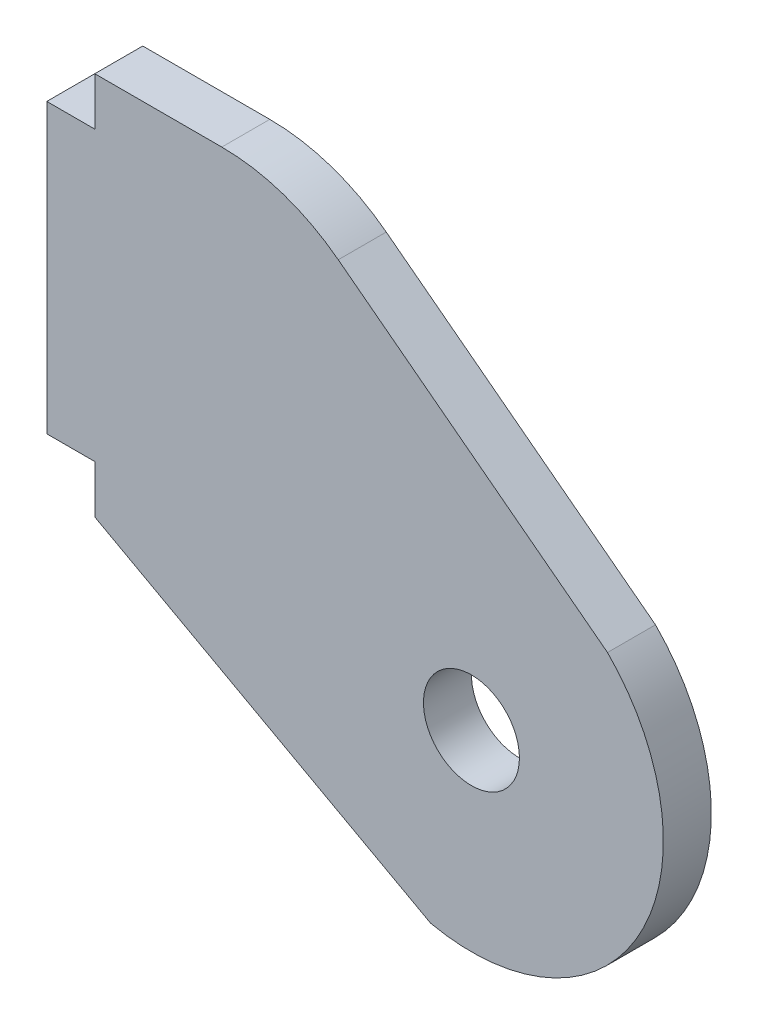
ISO-10303-21;
HEADER;
FILE_DESCRIPTION(('STEP AP214'),'2;1');
FILE_NAME('part.step','',(''),(''),'','','');
FILE_SCHEMA(('AUTOMOTIVE_DESIGN { 1 0 10303 214 1 1 1 1 }'));
ENDSEC;
DATA;
#1=APPLICATION_CONTEXT('core data for automotive mechanical design processes');
#2=APPLICATION_PROTOCOL_DEFINITION('international standard','automotive_design',2000,#1);
#3=PRODUCT_CONTEXT('',#1,'mechanical');
#4=PRODUCT('Part','Part','',(#3));
#5=PRODUCT_RELATED_PRODUCT_CATEGORY('part','',(#4));
#6=PRODUCT_DEFINITION_FORMATION('','',#4);
#7=PRODUCT_DEFINITION_CONTEXT('part definition',#1,'design');
#8=PRODUCT_DEFINITION('design','',#6,#7);
#9=PRODUCT_DEFINITION_SHAPE('','',#8);
#10=(LENGTH_UNIT() NAMED_UNIT(*) SI_UNIT(.MILLI.,.METRE.));
#11=(NAMED_UNIT(*) PLANE_ANGLE_UNIT() SI_UNIT($,.RADIAN.));
#12=(NAMED_UNIT(*) SI_UNIT($,.STERADIAN.) SOLID_ANGLE_UNIT());
#13=UNCERTAINTY_MEASURE_WITH_UNIT(LENGTH_MEASURE(1.E-05),#10,'distance_accuracy_value','');
#14=(GEOMETRIC_REPRESENTATION_CONTEXT(3) GLOBAL_UNCERTAINTY_ASSIGNED_CONTEXT((#13)) GLOBAL_UNIT_ASSIGNED_CONTEXT((#10,
#11,#12)) REPRESENTATION_CONTEXT('',''));
#15=CARTESIAN_POINT('',(0.,0.,0.));
#16=DIRECTION('',(0.,0.,1.));
#17=DIRECTION('',(1.,0.,0.));
#18=AXIS2_PLACEMENT_3D('',#15,#16,#17);
#19=CARTESIAN_POINT('',(427.91942335712,0.,3.175));
#20=DIRECTION('',(1.,0.,0.));
#21=DIRECTION('',(0.,0.,-1.));
#22=AXIS2_PLACEMENT_3D('',#19,#20,#21);
#23=PLANE('',#22);
#24=DIRECTION('',(0.,-1.,0.));
#25=VECTOR('',#24,1.);
#26=CARTESIAN_POINT('',(427.91942335712,0.,0.));
#27=LINE('',#26,#25);
#28=CARTESIAN_POINT('',(427.91942335712,0.,0.));
#29=VERTEX_POINT('',#28);
#30=CARTESIAN_POINT('',(427.91942335712,-3.17499999999997,0.));
#31=VERTEX_POINT('',#30);
#32=EDGE_CURVE('E137',#29,#31,#27,.T.);
#33=ORIENTED_EDGE('',*,*,#32,.T.);
#34=DIRECTION('',(0.,0.,-1.));
#35=VECTOR('',#34,1.);
#36=CARTESIAN_POINT('',(427.91942335712,-3.17499999999997,3.175));
#37=LINE('',#36,#35);
#38=CARTESIAN_POINT('',(427.91942335712,-3.17499999999997,3.175));
#39=VERTEX_POINT('',#38);
#40=EDGE_CURVE('E118',#39,#31,#37,.T.);
#41=ORIENTED_EDGE('',*,*,#40,.F.);
#42=DIRECTION('',(0.,-1.,0.));
#43=VECTOR('',#42,1.);
#44=CARTESIAN_POINT('',(427.91942335712,0.,3.175));
#45=LINE('',#44,#43);
#46=CARTESIAN_POINT('',(427.91942335712,0.,3.175));
#47=VERTEX_POINT('',#46);
#48=EDGE_CURVE('E125',#47,#39,#45,.T.);
#49=ORIENTED_EDGE('',*,*,#48,.F.);
#50=DIRECTION('',(0.,0.,-1.));
#51=VECTOR('',#50,1.);
#52=CARTESIAN_POINT('',(427.91942335712,0.,3.175));
#53=LINE('',#52,#51);
#54=EDGE_CURVE('E158',#47,#29,#53,.T.);
#55=ORIENTED_EDGE('',*,*,#54,.T.);
#56=EDGE_LOOP('',(#33,#41,#49,#55));
#57=FACE_BOUND('',#56,.T.);
#58=ADVANCED_FACE('F37',(#57),#23,.F.);
#59=CARTESIAN_POINT('',(424.74442335712,-3.17499999999998,3.175));
#60=DIRECTION('',(0.,-1.,0.));
#61=DIRECTION('',(1.,0.,0.));
#62=AXIS2_PLACEMENT_3D('',#59,#60,#61);
#63=PLANE('',#62);
#64=DIRECTION('',(-1.,0.,0.));
#65=VECTOR('',#64,1.);
#66=CARTESIAN_POINT('',(424.74442335712,-3.17499999999998,0.));
#67=LINE('',#66,#65);
#68=CARTESIAN_POINT('',(424.74442335712,-3.17499999999998,0.));
#69=VERTEX_POINT('',#68);
#70=EDGE_CURVE('E167',#31,#69,#67,.T.);
#71=ORIENTED_EDGE('',*,*,#70,.T.);
#72=DIRECTION('',(0.,0.,-1.));
#73=VECTOR('',#72,1.);
#74=CARTESIAN_POINT('',(424.74442335712,-3.17499999999998,3.175));
#75=LINE('',#74,#73);
#76=CARTESIAN_POINT('',(424.74442335712,-3.17499999999998,3.175));
#77=VERTEX_POINT('',#76);
#78=EDGE_CURVE('E121',#77,#69,#75,.T.);
#79=ORIENTED_EDGE('',*,*,#78,.F.);
#80=DIRECTION('',(-1.,0.,0.));
#81=VECTOR('',#80,1.);
#82=CARTESIAN_POINT('',(424.74442335712,-3.17499999999998,3.175));
#83=LINE('',#82,#81);
#84=EDGE_CURVE('E113',#39,#77,#83,.T.);
#85=ORIENTED_EDGE('',*,*,#84,.F.);
#86=ORIENTED_EDGE('',*,*,#40,.T.);
#87=EDGE_LOOP('',(#71,#79,#85,#86));
#88=FACE_BOUND('',#87,.T.);
#89=ADVANCED_FACE('F116',(#88),#63,.F.);
#90=CARTESIAN_POINT('',(424.74442335712,-22.225,3.175));
#91=DIRECTION('',(1.,0.,0.));
#92=DIRECTION('',(0.,0.,-1.));
#93=AXIS2_PLACEMENT_3D('',#90,#91,#92);
#94=PLANE('',#93);
#95=DIRECTION('',(0.,-1.,0.));
#96=VECTOR('',#95,1.);
#97=CARTESIAN_POINT('',(424.74442335712,-22.225,0.));
#98=LINE('',#97,#96);
#99=CARTESIAN_POINT('',(424.74442335712,-22.225,0.));
#100=VERTEX_POINT('',#99);
#101=EDGE_CURVE('E170',#69,#100,#98,.T.);
#102=ORIENTED_EDGE('',*,*,#101,.T.);
#103=DIRECTION('',(0.,0.,-1.));
#104=VECTOR('',#103,1.);
#105=CARTESIAN_POINT('',(424.74442335712,-22.225,3.175));
#106=LINE('',#105,#104);
#107=CARTESIAN_POINT('',(424.74442335712,-22.225,3.175));
#108=VERTEX_POINT('',#107);
#109=EDGE_CURVE('E142',#108,#100,#106,.T.);
#110=ORIENTED_EDGE('',*,*,#109,.F.);
#111=DIRECTION('',(0.,-1.,0.));
#112=VECTOR('',#111,1.);
#113=CARTESIAN_POINT('',(424.74442335712,-22.225,3.175));
#114=LINE('',#113,#112);
#115=EDGE_CURVE('E124',#77,#108,#114,.T.);
#116=ORIENTED_EDGE('',*,*,#115,.F.);
#117=ORIENTED_EDGE('',*,*,#78,.T.);
#118=EDGE_LOOP('',(#102,#110,#116,#117));
#119=FACE_BOUND('',#118,.T.);
#120=ADVANCED_FACE('F203',(#119),#94,.F.);
#121=CARTESIAN_POINT('',(427.91942335712,-22.225,3.175));
#122=DIRECTION('',(0.,1.,0.));
#123=DIRECTION('',(-1.,0.,0.));
#124=AXIS2_PLACEMENT_3D('',#121,#122,#123);
#125=PLANE('',#124);
#126=DIRECTION('',(1.,0.,0.));
#127=VECTOR('',#126,1.);
#128=CARTESIAN_POINT('',(427.91942335712,-22.225,0.));
#129=LINE('',#128,#127);
#130=CARTESIAN_POINT('',(427.91942335712,-22.225,0.));
#131=VERTEX_POINT('',#130);
#132=EDGE_CURVE('E173',#100,#131,#129,.T.);
#133=ORIENTED_EDGE('',*,*,#132,.T.);
#134=DIRECTION('',(0.,0.,-1.));
#135=VECTOR('',#134,1.);
#136=CARTESIAN_POINT('',(427.91942335712,-22.225,3.175));
#137=LINE('',#136,#135);
#138=CARTESIAN_POINT('',(427.91942335712,-22.225,3.175));
#139=VERTEX_POINT('',#138);
#140=EDGE_CURVE('E193',#139,#131,#137,.T.);
#141=ORIENTED_EDGE('',*,*,#140,.F.);
#142=DIRECTION('',(1.,0.,0.));
#143=VECTOR('',#142,1.);
#144=CARTESIAN_POINT('',(427.91942335712,-22.225,3.175));
#145=LINE('',#144,#143);
#146=EDGE_CURVE('E201',#108,#139,#145,.T.);
#147=ORIENTED_EDGE('',*,*,#146,.F.);
#148=ORIENTED_EDGE('',*,*,#109,.T.);
#149=EDGE_LOOP('',(#133,#141,#147,#148));
#150=FACE_BOUND('',#149,.T.);
#151=ADVANCED_FACE('F198',(#150),#125,.F.);
#152=CARTESIAN_POINT('',(427.91942335712,-22.225,3.175));
#153=DIRECTION('',(1.,0.,0.));
#154=DIRECTION('',(0.,0.,-1.));
#155=AXIS2_PLACEMENT_3D('',#152,#153,#154);
#156=PLANE('',#155);
#157=DIRECTION('',(0.,-1.,0.));
#158=VECTOR('',#157,1.);
#159=CARTESIAN_POINT('',(427.91942335712,-22.225,0.));
#160=LINE('',#159,#158);
#161=CARTESIAN_POINT('',(427.91942335712,-25.3999999999999,0.));
#162=VERTEX_POINT('',#161);
#163=EDGE_CURVE('E176',#131,#162,#160,.T.);
#164=ORIENTED_EDGE('',*,*,#163,.T.);
#165=DIRECTION('',(0.,0.,-1.));
#166=VECTOR('',#165,1.);
#167=CARTESIAN_POINT('',(427.91942335712,-25.3999999999999,3.175));
#168=LINE('',#167,#166);
#169=CARTESIAN_POINT('',(427.91942335712,-25.3999999999999,3.175));
#170=VERTEX_POINT('',#169);
#171=EDGE_CURVE('E190',#170,#162,#168,.T.);
#172=ORIENTED_EDGE('',*,*,#171,.F.);
#173=DIRECTION('',(0.,-1.,0.));
#174=VECTOR('',#173,1.);
#175=CARTESIAN_POINT('',(427.91942335712,-22.225,3.175));
#176=LINE('',#175,#174);
#177=EDGE_CURVE('E208',#139,#170,#176,.T.);
#178=ORIENTED_EDGE('',*,*,#177,.F.);
#179=ORIENTED_EDGE('',*,*,#140,.T.);
#180=EDGE_LOOP('',(#164,#172,#178,#179));
#181=FACE_BOUND('',#180,.T.);
#182=ADVANCED_FACE('F206',(#181),#156,.F.);
#183=CARTESIAN_POINT('',(427.91942335712,-25.3999999999999,3.175));
#184=DIRECTION('',(0.480325676751226,0.87709021443263,0.));
#185=DIRECTION('',(-0.87709021443263,0.480325676751226,0.));
#186=AXIS2_PLACEMENT_3D('',#183,#184,#185);
#187=PLANE('',#186);
#188=DIRECTION('',(0.87709021443263,-0.480325676751225,0.));
#189=VECTOR('',#188,1.);
#190=CARTESIAN_POINT('',(427.91942335712,-25.3999999999999,0.));
#191=LINE('',#190,#189);
#192=CARTESIAN_POINT('',(450.14442335712,-37.5711974322978,0.));
#193=VERTEX_POINT('',#192);
#194=EDGE_CURVE('E179',#162,#193,#191,.T.);
#195=ORIENTED_EDGE('',*,*,#194,.T.);
#196=DIRECTION('',(0.,0.,-1.));
#197=VECTOR('',#196,1.);
#198=CARTESIAN_POINT('',(450.14442335712,-37.5711974322978,3.175));
#199=LINE('',#198,#197);
#200=CARTESIAN_POINT('',(450.14442335712,-37.5711974322978,3.175));
#201=VERTEX_POINT('',#200);
#202=EDGE_CURVE('E187',#201,#193,#199,.T.);
#203=ORIENTED_EDGE('',*,*,#202,.F.);
#204=DIRECTION('',(0.87709021443263,-0.480325676751225,0.));
#205=VECTOR('',#204,1.);
#206=CARTESIAN_POINT('',(427.91942335712,-25.3999999999999,3.175));
#207=LINE('',#206,#205);
#208=EDGE_CURVE('E210',#170,#201,#207,.T.);
#209=ORIENTED_EDGE('',*,*,#208,.F.);
#210=ORIENTED_EDGE('',*,*,#171,.T.);
#211=EDGE_LOOP('',(#195,#203,#209,#210));
#212=FACE_BOUND('',#211,.T.);
#213=ADVANCED_FACE('F220',(#212),#187,.F.);
#214=CARTESIAN_POINT('',(452.84317335712,-25.1612518869902,3.175));
#215=DIRECTION('',(0.,0.,-1.));
#216=DIRECTION('',(-1.,0.,0.));
#217=AXIS2_PLACEMENT_3D('',#214,#215,#216);
#218=CYLINDRICAL_SURFACE('',#217,12.7);
#219=CARTESIAN_POINT('',(452.84317335712,-25.1612518869902,0.));
#220=DIRECTION('',(0.,0.,1.));
#221=DIRECTION('',(1.,0.,0.));
#222=AXIS2_PLACEMENT_3D('',#219,#220,#221);
#223=CIRCLE('',#222,12.7);
#224=CARTESIAN_POINT('',(461.846041333275,-16.2036647004802,0.));
#225=VERTEX_POINT('',#224);
#226=EDGE_CURVE('E182',#193,#225,#223,.T.);
#227=ORIENTED_EDGE('',*,*,#226,.T.);
#228=DIRECTION('',(0.,0.,-1.));
#229=VECTOR('',#228,1.);
#230=CARTESIAN_POINT('',(461.846041333275,-16.2036647004802,3.175));
#231=LINE('',#230,#229);
#232=CARTESIAN_POINT('',(461.846041333275,-16.2036647004802,3.175));
#233=VERTEX_POINT('',#232);
#234=EDGE_CURVE('E160',#233,#225,#231,.T.);
#235=ORIENTED_EDGE('',*,*,#234,.F.);
#236=CARTESIAN_POINT('',(452.84317335712,-25.1612518869902,3.175));
#237=DIRECTION('',(0.,0.,1.));
#238=DIRECTION('',(1.,0.,0.));
#239=AXIS2_PLACEMENT_3D('',#236,#237,#238);
#240=CIRCLE('',#239,12.7);
#241=EDGE_CURVE('E162',#201,#233,#240,.T.);
#242=ORIENTED_EDGE('',*,*,#241,.F.);
#243=ORIENTED_EDGE('',*,*,#202,.T.);
#244=EDGE_LOOP('',(#227,#235,#242,#243));
#245=FACE_BOUND('',#244,.T.);
#246=ADVANCED_FACE('F218',(#245),#218,.T.);
#247=CARTESIAN_POINT('',(440.61942335712,0.,3.175));
#248=DIRECTION('',(-0.606777523421596,-0.794871711076923,0.));
#249=DIRECTION('',(0.794871711076923,-0.606777523421596,0.));
#250=AXIS2_PLACEMENT_3D('',#247,#248,#249);
#251=PLANE('',#250);
#252=DIRECTION('',(-0.794871711076923,0.606777523421596,0.));
#253=VECTOR('',#252,1.);
#254=CARTESIAN_POINT('',(440.61942335712,0.,0.));
#255=LINE('',#254,#253);
#256=CARTESIAN_POINT('',(444.03211331341,-2.60512926932308,0.));
#257=VERTEX_POINT('',#256);
#258=EDGE_CURVE('E153',#225,#257,#255,.T.);
#259=ORIENTED_EDGE('',*,*,#258,.T.);
#260=DIRECTION('',(0.,0.,-1.));
#261=VECTOR('',#260,1.);
#262=CARTESIAN_POINT('',(444.03211331341,-2.60512926932308,3.175));
#263=LINE('',#262,#261);
#264=CARTESIAN_POINT('',(444.03211331341,-2.60512926932308,3.175));
#265=VERTEX_POINT('',#264);
#266=EDGE_CURVE('E45',#257,#265,#263,.F.);
#267=ORIENTED_EDGE('',*,*,#266,.T.);
#268=DIRECTION('',(-0.794871711076923,0.606777523421596,0.));
#269=VECTOR('',#268,1.);
#270=CARTESIAN_POINT('',(440.61942335712,0.,3.175));
#271=LINE('',#270,#269);
#272=EDGE_CURVE('E151',#233,#265,#271,.T.);
#273=ORIENTED_EDGE('',*,*,#272,.F.);
#274=ORIENTED_EDGE('',*,*,#234,.T.);
#275=EDGE_LOOP('',(#259,#267,#273,#274));
#276=FACE_BOUND('',#275,.T.);
#277=ADVANCED_FACE('F149',(#276),#251,.F.);
#278=CARTESIAN_POINT('',(427.91942335712,0.,3.175));
#279=DIRECTION('',(0.,-1.,0.));
#280=DIRECTION('',(0.,0.,-1.));
#281=AXIS2_PLACEMENT_3D('',#278,#279,#280);
#282=PLANE('',#281);
#283=DIRECTION('',(-1.,0.,0.));
#284=VECTOR('',#283,1.);
#285=CARTESIAN_POINT('',(427.91942335712,0.,3.175));
#286=LINE('',#285,#284);
#287=CARTESIAN_POINT('',(436.326038765956,0.,3.175));
#288=VERTEX_POINT('',#287);
#289=EDGE_CURVE('E130',#288,#47,#286,.T.);
#290=ORIENTED_EDGE('',*,*,#289,.F.);
#291=DIRECTION('',(0.,0.,-1.));
#292=VECTOR('',#291,1.);
#293=CARTESIAN_POINT('',(436.326038765956,0.,3.175));
#294=LINE('',#293,#292);
#295=CARTESIAN_POINT('',(436.326038765956,0.,0.));
#296=VERTEX_POINT('',#295);
#297=EDGE_CURVE('E138',#288,#296,#294,.T.);
#298=ORIENTED_EDGE('',*,*,#297,.T.);
#299=DIRECTION('',(-1.,0.,0.));
#300=VECTOR('',#299,1.);
#301=CARTESIAN_POINT('',(427.91942335712,0.,0.));
#302=LINE('',#301,#300);
#303=EDGE_CURVE('E134',#296,#29,#302,.T.);
#304=ORIENTED_EDGE('',*,*,#303,.T.);
#305=ORIENTED_EDGE('',*,*,#54,.F.);
#306=EDGE_LOOP('',(#290,#298,#304,#305));
#307=FACE_BOUND('',#306,.T.);
#308=ADVANCED_FACE('F157',(#307),#282,.F.);
#309=CARTESIAN_POINT('',(452.84317335712,-25.1612518869902,3.175));
#310=DIRECTION('',(0.,0.,1.));
#311=DIRECTION('',(1.,0.,0.));
#312=AXIS2_PLACEMENT_3D('',#309,#310,#311);
#313=PLANE('',#312);
#314=CARTESIAN_POINT('',(452.84317335712,-25.1612518869902,3.175));
#315=DIRECTION('',(0.,0.,1.));
#316=DIRECTION('',(1.,0.,0.));
#317=AXIS2_PLACEMENT_3D('',#314,#315,#316);
#318=CIRCLE('',#317,3.17499999999998);
#319=CARTESIAN_POINT('',(456.01817335712,-25.1612518869902,3.175));
#320=VERTEX_POINT('',#319);
#321=EDGE_CURVE('E314',#320,#320,#318,.T.);
#322=ORIENTED_EDGE('',*,*,#321,.F.);
#323=EDGE_LOOP('',(#322));
#324=FACE_BOUND('',#323,.T.);
#325=ORIENTED_EDGE('',*,*,#272,.T.);
#326=CARTESIAN_POINT('',(436.326038765956,-12.7,3.175));
#327=DIRECTION('',(0.,0.,1.));
#328=DIRECTION('',(1.,0.,0.));
#329=AXIS2_PLACEMENT_3D('',#326,#327,#328);
#330=CIRCLE('',#329,12.7);
#331=EDGE_CURVE('E11',#265,#288,#330,.T.);
#332=ORIENTED_EDGE('',*,*,#331,.T.);
#333=ORIENTED_EDGE('',*,*,#289,.T.);
#334=ORIENTED_EDGE('',*,*,#48,.T.);
#335=ORIENTED_EDGE('',*,*,#84,.T.);
#336=ORIENTED_EDGE('',*,*,#115,.T.);
#337=ORIENTED_EDGE('',*,*,#146,.T.);
#338=ORIENTED_EDGE('',*,*,#177,.T.);
#339=ORIENTED_EDGE('',*,*,#208,.T.);
#340=ORIENTED_EDGE('',*,*,#241,.T.);
#341=EDGE_LOOP('',(#325,#332,#333,#334,#335,#336,#337,#338,#339,#340));
#342=FACE_BOUND('',#341,.T.);
#343=ADVANCED_FACE('F128',(#324,#342),#313,.T.);
#344=CARTESIAN_POINT('',(452.84317335712,-25.1612518869902,0.));
#345=DIRECTION('',(0.,0.,1.));
#346=DIRECTION('',(1.,0.,0.));
#347=AXIS2_PLACEMENT_3D('',#344,#345,#346);
#348=PLANE('',#347);
#349=CARTESIAN_POINT('',(452.84317335712,-25.1612518869902,0.));
#350=DIRECTION('',(0.,0.,1.));
#351=DIRECTION('',(1.,0.,0.));
#352=AXIS2_PLACEMENT_3D('',#349,#350,#351);
#353=CIRCLE('',#352,3.17499999999998);
#354=CARTESIAN_POINT('',(456.01817335712,-25.1612518869902,0.));
#355=VERTEX_POINT('',#354);
#356=EDGE_CURVE('E168',#355,#355,#353,.T.);
#357=ORIENTED_EDGE('',*,*,#356,.T.);
#358=EDGE_LOOP('',(#357));
#359=FACE_BOUND('',#358,.T.);
#360=ORIENTED_EDGE('',*,*,#303,.F.);
#361=CARTESIAN_POINT('',(436.326038765956,-12.7,0.));
#362=DIRECTION('',(0.,0.,1.));
#363=DIRECTION('',(1.,0.,0.));
#364=AXIS2_PLACEMENT_3D('',#361,#362,#363);
#365=CIRCLE('',#364,12.7);
#366=EDGE_CURVE('E58',#296,#257,#365,.F.);
#367=ORIENTED_EDGE('',*,*,#366,.T.);
#368=ORIENTED_EDGE('',*,*,#258,.F.);
#369=ORIENTED_EDGE('',*,*,#226,.F.);
#370=ORIENTED_EDGE('',*,*,#194,.F.);
#371=ORIENTED_EDGE('',*,*,#163,.F.);
#372=ORIENTED_EDGE('',*,*,#132,.F.);
#373=ORIENTED_EDGE('',*,*,#101,.F.);
#374=ORIENTED_EDGE('',*,*,#70,.F.);
#375=ORIENTED_EDGE('',*,*,#32,.F.);
#376=EDGE_LOOP('',(#360,#367,#368,#369,#370,#371,#372,#373,#374,#375));
#377=FACE_BOUND('',#376,.T.);
#378=ADVANCED_FACE('F154',(#359,#377),#348,.F.);
#379=CARTESIAN_POINT('',(452.84317335712,-25.1612518869902,3.175));
#380=DIRECTION('',(0.,0.,1.));
#381=DIRECTION('',(1.,0.,0.));
#382=AXIS2_PLACEMENT_3D('',#379,#380,#381);
#383=CYLINDRICAL_SURFACE('',#382,3.17499999999998);
#384=ORIENTED_EDGE('',*,*,#321,.T.);
#385=EDGE_LOOP('',(#384));
#386=FACE_BOUND('',#385,.T.);
#387=ORIENTED_EDGE('',*,*,#356,.F.);
#388=EDGE_LOOP('',(#387));
#389=FACE_BOUND('',#388,.T.);
#390=ADVANCED_FACE('F290',(#386,#389),#383,.F.);
#391=CARTESIAN_POINT('',(436.326038765956,-12.7,3.175));
#392=DIRECTION('',(0.,0.,-1.));
#393=DIRECTION('',(-1.,0.,0.));
#394=AXIS2_PLACEMENT_3D('',#391,#392,#393);
#395=CYLINDRICAL_SURFACE('',#394,12.7);
#396=ORIENTED_EDGE('',*,*,#331,.F.);
#397=ORIENTED_EDGE('',*,*,#266,.F.);
#398=ORIENTED_EDGE('',*,*,#366,.F.);
#399=ORIENTED_EDGE('',*,*,#297,.F.);
#400=EDGE_LOOP('',(#396,#397,#398,#399));
#401=FACE_BOUND('',#400,.T.);
#402=ADVANCED_FACE('F39',(#401),#395,.T.);
#403=CLOSED_SHELL('',(#58,#89,#120,#151,#182,#213,#246,#277,#308,#343,#378,#390,#402));
#404=MANIFOLD_SOLID_BREP('B2',#403);
#405=ADVANCED_BREP_SHAPE_REPRESENTATION('',(#18,#404),#14);
#406=SHAPE_DEFINITION_REPRESENTATION(#9,#405);
ENDSEC;
END-ISO-10303-21;
